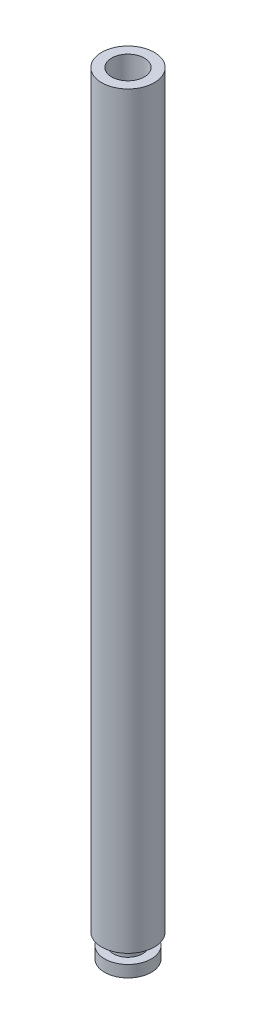
ISO-10303-21;
HEADER;
FILE_DESCRIPTION(('STEP AP214'),'2;1');
FILE_NAME('part.step','',(''),(''),'','','');
FILE_SCHEMA(('AUTOMOTIVE_DESIGN { 1 0 10303 214 1 1 1 1 }'));
ENDSEC;
DATA;
#1=APPLICATION_CONTEXT('core data for automotive mechanical design processes');
#2=APPLICATION_PROTOCOL_DEFINITION('international standard','automotive_design',2000,#1);
#3=PRODUCT_CONTEXT('',#1,'mechanical');
#4=PRODUCT('Part','Part','',(#3));
#5=PRODUCT_RELATED_PRODUCT_CATEGORY('part','',(#4));
#6=PRODUCT_DEFINITION_FORMATION('','',#4);
#7=PRODUCT_DEFINITION_CONTEXT('part definition',#1,'design');
#8=PRODUCT_DEFINITION('design','',#6,#7);
#9=PRODUCT_DEFINITION_SHAPE('','',#8);
#10=(LENGTH_UNIT() NAMED_UNIT(*) SI_UNIT(.MILLI.,.METRE.));
#11=(NAMED_UNIT(*) PLANE_ANGLE_UNIT() SI_UNIT($,.RADIAN.));
#12=(NAMED_UNIT(*) SI_UNIT($,.STERADIAN.) SOLID_ANGLE_UNIT());
#13=UNCERTAINTY_MEASURE_WITH_UNIT(LENGTH_MEASURE(1.E-05),#10,'distance_accuracy_value','');
#14=(GEOMETRIC_REPRESENTATION_CONTEXT(3) GLOBAL_UNCERTAINTY_ASSIGNED_CONTEXT((#13)) GLOBAL_UNIT_ASSIGNED_CONTEXT((#10,
#11,#12)) REPRESENTATION_CONTEXT('',''));
#15=CARTESIAN_POINT('',(0.,0.,0.));
#16=DIRECTION('',(0.,0.,1.));
#17=DIRECTION('',(1.,0.,0.));
#18=AXIS2_PLACEMENT_3D('',#15,#16,#17);
#19=CARTESIAN_POINT('',(-0.522013311509166,64.,-0.51113803418606));
#20=DIRECTION('',(0.,-1.,0.));
#21=DIRECTION('',(0.,0.,-1.));
#22=AXIS2_PLACEMENT_3D('',#19,#20,#21);
#23=CYLINDRICAL_SURFACE('',#22,2.25);
#24=CARTESIAN_POINT('',(-0.522013311509166,64.,-0.51113803418606));
#25=DIRECTION('',(0.,1.,0.));
#26=DIRECTION('',(0.,0.,1.));
#27=AXIS2_PLACEMENT_3D('',#24,#25,#26);
#28=CIRCLE('',#27,2.25);
#29=CARTESIAN_POINT('',(-0.522013311509166,64.,1.73886196581394));
#30=VERTEX_POINT('',#29);
#31=EDGE_CURVE('E53',#30,#30,#28,.T.);
#32=ORIENTED_EDGE('',*,*,#31,.F.);
#33=EDGE_LOOP('',(#32));
#34=FACE_BOUND('',#33,.T.);
#35=CARTESIAN_POINT('',(-0.522013311509166,0.,-0.51113803418606));
#36=DIRECTION('',(0.,1.,0.));
#37=DIRECTION('',(0.,0.,1.));
#38=AXIS2_PLACEMENT_3D('',#35,#36,#37);
#39=CIRCLE('',#38,2.25);
#40=CARTESIAN_POINT('',(-0.522013311509166,0.,1.73886196581394));
#41=VERTEX_POINT('',#40);
#42=EDGE_CURVE('E48',#41,#41,#39,.T.);
#43=ORIENTED_EDGE('',*,*,#42,.T.);
#44=EDGE_LOOP('',(#43));
#45=FACE_BOUND('',#44,.T.);
#46=ADVANCED_FACE('F45',(#34,#45),#23,.T.);
#47=CARTESIAN_POINT('',(-0.522013311509166,64.,-0.51113803418606));
#48=DIRECTION('',(0.,1.,0.));
#49=DIRECTION('',(0.,0.,1.));
#50=AXIS2_PLACEMENT_3D('',#47,#48,#49);
#51=PLANE('',#50);
#52=CARTESIAN_POINT('',(-0.522013311509166,64.,-0.51113803418606));
#53=DIRECTION('',(0.,1.,0.));
#54=DIRECTION('',(0.,0.,1.));
#55=AXIS2_PLACEMENT_3D('',#52,#53,#54);
#56=CIRCLE('',#55,1.4);
#57=CARTESIAN_POINT('',(-0.522013311509166,64.,0.88886196581394));
#58=VERTEX_POINT('',#57);
#59=EDGE_CURVE('E73',#58,#58,#56,.T.);
#60=ORIENTED_EDGE('',*,*,#59,.F.);
#61=EDGE_LOOP('',(#60));
#62=FACE_BOUND('',#61,.T.);
#63=ORIENTED_EDGE('',*,*,#31,.T.);
#64=EDGE_LOOP('',(#63));
#65=FACE_BOUND('',#64,.T.);
#66=ADVANCED_FACE('F90',(#62,#65),#51,.T.);
#67=CARTESIAN_POINT('',(-0.522013311509166,0.,-0.51113803418606));
#68=DIRECTION('',(0.,1.,0.));
#69=DIRECTION('',(0.,0.,1.));
#70=AXIS2_PLACEMENT_3D('',#67,#68,#69);
#71=PLANE('',#70);
#72=CARTESIAN_POINT('',(-0.522013311509166,0.,-0.51113803418606));
#73=DIRECTION('',(0.,-1.,0.));
#74=DIRECTION('',(0.,0.,-1.));
#75=AXIS2_PLACEMENT_3D('',#72,#73,#74);
#76=CIRCLE('',#75,1.25);
#77=CARTESIAN_POINT('',(-0.522013311509166,0.,-1.76113803418606));
#78=VERTEX_POINT('',#77);
#79=EDGE_CURVE('E10',#78,#78,#76,.T.);
#80=ORIENTED_EDGE('',*,*,#79,.F.);
#81=EDGE_LOOP('',(#80));
#82=FACE_BOUND('',#81,.T.);
#83=ORIENTED_EDGE('',*,*,#42,.F.);
#84=EDGE_LOOP('',(#83));
#85=FACE_BOUND('',#84,.T.);
#86=ADVANCED_FACE('F93',(#82,#85),#71,.F.);
#87=CARTESIAN_POINT('',(-0.522013311509166,-1.,-0.51113803418606));
#88=DIRECTION('',(0.,1.,0.));
#89=DIRECTION('',(0.,0.,1.));
#90=AXIS2_PLACEMENT_3D('',#87,#88,#89);
#91=CYLINDRICAL_SURFACE('',#90,1.25);
#92=CARTESIAN_POINT('',(-0.522013311509166,-1.,-0.51113803418606));
#93=DIRECTION('',(0.,-1.,0.));
#94=DIRECTION('',(0.,0.,-1.));
#95=AXIS2_PLACEMENT_3D('',#92,#93,#94);
#96=CIRCLE('',#95,1.25);
#97=CARTESIAN_POINT('',(-0.522013311509166,-1.,-1.76113803418606));
#98=VERTEX_POINT('',#97);
#99=EDGE_CURVE('E60',#98,#98,#96,.T.);
#100=ORIENTED_EDGE('',*,*,#99,.F.);
#101=EDGE_LOOP('',(#100));
#102=FACE_BOUND('',#101,.T.);
#103=ORIENTED_EDGE('',*,*,#79,.T.);
#104=EDGE_LOOP('',(#103));
#105=FACE_BOUND('',#104,.T.);
#106=ADVANCED_FACE('F104',(#102,#105),#91,.T.);
#107=CARTESIAN_POINT('',(-0.522013311509166,-2.,-0.51113803418606));
#108=DIRECTION('',(0.,1.,0.));
#109=DIRECTION('',(0.,0.,1.));
#110=AXIS2_PLACEMENT_3D('',#107,#108,#109);
#111=CYLINDRICAL_SURFACE('',#110,2.);
#112=CARTESIAN_POINT('',(-0.522013311509166,-2.,-0.51113803418606));
#113=DIRECTION('',(0.,-1.,0.));
#114=DIRECTION('',(0.,0.,-1.));
#115=AXIS2_PLACEMENT_3D('',#112,#113,#114);
#116=CIRCLE('',#115,2.);
#117=CARTESIAN_POINT('',(-0.522013311509166,-2.,-2.51113803418606));
#118=VERTEX_POINT('',#117);
#119=EDGE_CURVE('E64',#118,#118,#116,.T.);
#120=ORIENTED_EDGE('',*,*,#119,.F.);
#121=EDGE_LOOP('',(#120));
#122=FACE_BOUND('',#121,.T.);
#123=CARTESIAN_POINT('',(-0.522013311509166,-1.,-0.51113803418606));
#124=DIRECTION('',(0.,-1.,0.));
#125=DIRECTION('',(0.,0.,-1.));
#126=AXIS2_PLACEMENT_3D('',#123,#124,#125);
#127=CIRCLE('',#126,2.);
#128=CARTESIAN_POINT('',(-0.522013311509166,-1.,-2.51113803418606));
#129=VERTEX_POINT('',#128);
#130=EDGE_CURVE('E65',#129,#129,#127,.T.);
#131=ORIENTED_EDGE('',*,*,#130,.T.);
#132=EDGE_LOOP('',(#131));
#133=FACE_BOUND('',#132,.T.);
#134=ADVANCED_FACE('F109',(#122,#133),#111,.T.);
#135=CARTESIAN_POINT('',(-0.522013311509166,-2.,-0.51113803418606));
#136=DIRECTION('',(0.,-1.,0.));
#137=DIRECTION('',(0.,0.,-1.));
#138=AXIS2_PLACEMENT_3D('',#135,#136,#137);
#139=PLANE('',#138);
#140=ORIENTED_EDGE('',*,*,#119,.T.);
#141=EDGE_LOOP('',(#140));
#142=FACE_BOUND('',#141,.T.);
#143=ADVANCED_FACE('F115',(#142),#139,.T.);
#144=CARTESIAN_POINT('',(-0.522013311509166,-1.,-0.51113803418606));
#145=DIRECTION('',(0.,-1.,0.));
#146=DIRECTION('',(0.,0.,-1.));
#147=AXIS2_PLACEMENT_3D('',#144,#145,#146);
#148=PLANE('',#147);
#149=ORIENTED_EDGE('',*,*,#99,.T.);
#150=EDGE_LOOP('',(#149));
#151=FACE_BOUND('',#150,.T.);
#152=ORIENTED_EDGE('',*,*,#130,.F.);
#153=EDGE_LOOP('',(#152));
#154=FACE_BOUND('',#153,.T.);
#155=ADVANCED_FACE('F86',(#151,#154),#148,.F.);
#156=CARTESIAN_POINT('',(-0.522013311509166,56.5,-0.51113803418606));
#157=DIRECTION('',(0.,1.,0.));
#158=DIRECTION('',(0.,0.,1.));
#159=AXIS2_PLACEMENT_3D('',#156,#157,#158);
#160=CYLINDRICAL_SURFACE('',#159,1.4);
#161=CARTESIAN_POINT('',(-0.522013311509166,56.5,-0.51113803418606));
#162=DIRECTION('',(0.,1.,0.));
#163=DIRECTION('',(0.,0.,1.));
#164=AXIS2_PLACEMENT_3D('',#161,#162,#163);
#165=CIRCLE('',#164,1.4);
#166=CARTESIAN_POINT('',(-0.522013311509166,56.5,0.88886196581394));
#167=VERTEX_POINT('',#166);
#168=EDGE_CURVE('E69',#167,#167,#165,.T.);
#169=ORIENTED_EDGE('',*,*,#168,.F.);
#170=EDGE_LOOP('',(#169));
#171=FACE_BOUND('',#170,.T.);
#172=ORIENTED_EDGE('',*,*,#59,.T.);
#173=EDGE_LOOP('',(#172));
#174=FACE_BOUND('',#173,.T.);
#175=ADVANCED_FACE('F83',(#171,#174),#160,.F.);
#176=CARTESIAN_POINT('',(-0.522013311509166,56.5,-0.51113803418606));
#177=DIRECTION('',(0.,1.,0.));
#178=DIRECTION('',(0.,0.,1.));
#179=AXIS2_PLACEMENT_3D('',#176,#177,#178);
#180=PLANE('',#179);
#181=ORIENTED_EDGE('',*,*,#168,.T.);
#182=EDGE_LOOP('',(#181));
#183=FACE_BOUND('',#182,.T.);
#184=ADVANCED_FACE('F81',(#183),#180,.T.);
#185=CLOSED_SHELL('',(#46,#66,#86,#106,#134,#143,#155,#175,#184));
#186=MANIFOLD_SOLID_BREP('B2',#185);
#187=ADVANCED_BREP_SHAPE_REPRESENTATION('',(#18,#186),#14);
#188=SHAPE_DEFINITION_REPRESENTATION(#9,#187);
ENDSEC;
END-ISO-10303-21;
